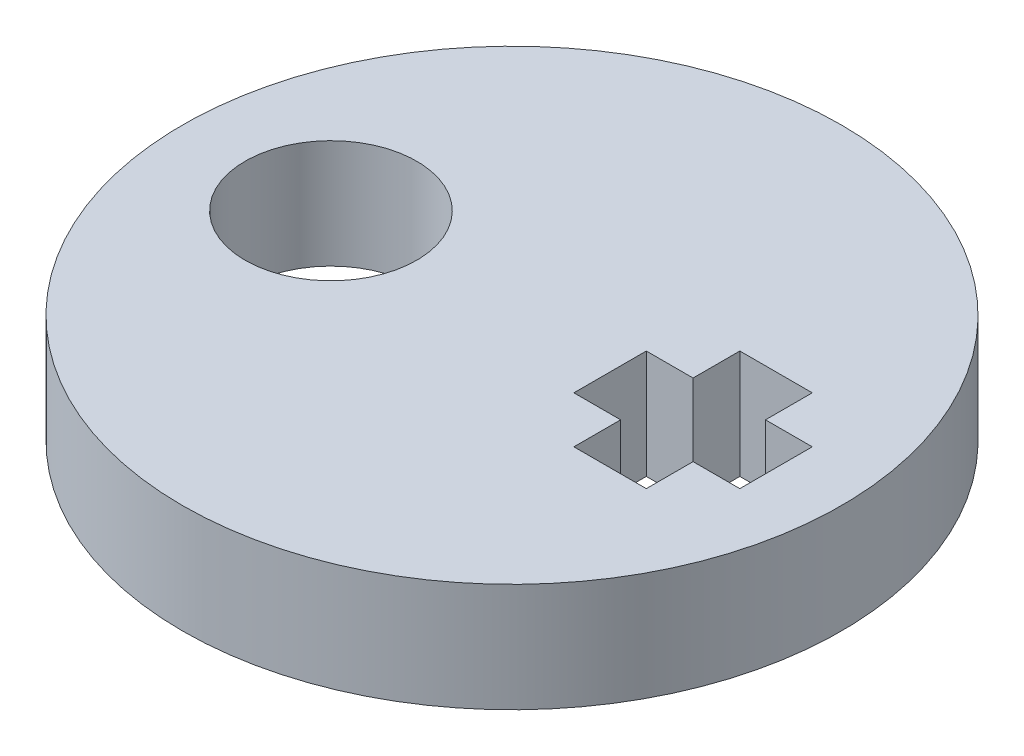
ISO-10303-21;
HEADER;
FILE_DESCRIPTION(('STEP AP214'),'2;1');
FILE_NAME('part.step','',(''),(''),'','','');
FILE_SCHEMA(('AUTOMOTIVE_DESIGN { 1 0 10303 214 1 1 1 1 }'));
ENDSEC;
DATA;
#1=APPLICATION_CONTEXT('core data for automotive mechanical design processes');
#2=APPLICATION_PROTOCOL_DEFINITION('international standard','automotive_design',2000,#1);
#3=PRODUCT_CONTEXT('',#1,'mechanical');
#4=PRODUCT('Part','Part','',(#3));
#5=PRODUCT_RELATED_PRODUCT_CATEGORY('part','',(#4));
#6=PRODUCT_DEFINITION_FORMATION('','',#4);
#7=PRODUCT_DEFINITION_CONTEXT('part definition',#1,'design');
#8=PRODUCT_DEFINITION('design','',#6,#7);
#9=PRODUCT_DEFINITION_SHAPE('','',#8);
#10=(LENGTH_UNIT() NAMED_UNIT(*) SI_UNIT(.MILLI.,.METRE.));
#11=(NAMED_UNIT(*) PLANE_ANGLE_UNIT() SI_UNIT($,.RADIAN.));
#12=(NAMED_UNIT(*) SI_UNIT($,.STERADIAN.) SOLID_ANGLE_UNIT());
#13=UNCERTAINTY_MEASURE_WITH_UNIT(LENGTH_MEASURE(1.E-05),#10,'distance_accuracy_value','');
#14=(GEOMETRIC_REPRESENTATION_CONTEXT(3) GLOBAL_UNCERTAINTY_ASSIGNED_CONTEXT((#13)) GLOBAL_UNIT_ASSIGNED_CONTEXT((#10,
#11,#12)) REPRESENTATION_CONTEXT('',''));
#15=CARTESIAN_POINT('',(0.,0.,0.));
#16=DIRECTION('',(0.,0.,1.));
#17=DIRECTION('',(1.,0.,0.));
#18=AXIS2_PLACEMENT_3D('',#15,#16,#17);
#19=CARTESIAN_POINT('',(0.,3.,0.));
#20=DIRECTION('',(0.,1.,0.));
#21=DIRECTION('',(0.,0.,1.));
#22=AXIS2_PLACEMENT_3D('',#19,#20,#21);
#23=PLANE('',#22);
#24=DIRECTION('',(-1.,0.,0.));
#25=VECTOR('',#24,1.);
#26=CARTESIAN_POINT('',(5.99999999999999,3.,-0.999999999999555));
#27=LINE('',#26,#25);
#28=CARTESIAN_POINT('',(7.29128784747793,3.,-0.999999999999554));
#29=VERTEX_POINT('',#28);
#30=CARTESIAN_POINT('',(5.99999999999999,3.,-0.999999999999555));
#31=VERTEX_POINT('',#30);
#32=EDGE_CURVE('E144',#29,#31,#27,.T.);
#33=ORIENTED_EDGE('',*,*,#32,.F.);
#34=DIRECTION('',(0.,0.,-1.));
#35=VECTOR('',#34,1.);
#36=CARTESIAN_POINT('',(7.29128784747793,3.,-0.999999999999554));
#37=LINE('',#36,#35);
#38=CARTESIAN_POINT('',(7.29128784747793,3.,1.00000000000043));
#39=VERTEX_POINT('',#38);
#40=EDGE_CURVE('E135',#39,#29,#37,.T.);
#41=ORIENTED_EDGE('',*,*,#40,.F.);
#42=DIRECTION('',(1.,0.,0.));
#43=VECTOR('',#42,1.);
#44=CARTESIAN_POINT('',(7.29128784747793,3.,1.00000000000043));
#45=LINE('',#44,#43);
#46=CARTESIAN_POINT('',(5.99999999999999,3.,1.00000000000043));
#47=VERTEX_POINT('',#46);
#48=EDGE_CURVE('E189',#47,#39,#45,.T.);
#49=ORIENTED_EDGE('',*,*,#48,.F.);
#50=DIRECTION('',(0.,0.,-1.));
#51=VECTOR('',#50,1.);
#52=CARTESIAN_POINT('',(5.99999999999999,3.,1.00000000000043));
#53=LINE('',#52,#51);
#54=CARTESIAN_POINT('',(5.99999999999999,3.,2.29128784747835));
#55=VERTEX_POINT('',#54);
#56=EDGE_CURVE('E186',#55,#47,#53,.T.);
#57=ORIENTED_EDGE('',*,*,#56,.F.);
#58=DIRECTION('',(1.,0.,1.67400815431763E-13));
#59=VECTOR('',#58,1.);
#60=CARTESIAN_POINT('',(5.99999999999999,3.,2.29128784747835));
#61=LINE('',#60,#59);
#62=CARTESIAN_POINT('',(4.00000000000001,3.,2.29128784747801));
#63=VERTEX_POINT('',#62);
#64=EDGE_CURVE('E183',#63,#55,#61,.T.);
#65=ORIENTED_EDGE('',*,*,#64,.F.);
#66=DIRECTION('',(0.,0.,1.));
#67=VECTOR('',#66,1.);
#68=CARTESIAN_POINT('',(4.00000000000001,3.,2.29128784747801));
#69=LINE('',#68,#67);
#70=CARTESIAN_POINT('',(4.00000000000001,3.,1.00000000000009));
#71=VERTEX_POINT('',#70);
#72=EDGE_CURVE('E180',#71,#63,#69,.T.);
#73=ORIENTED_EDGE('',*,*,#72,.F.);
#74=DIRECTION('',(1.,0.,0.));
#75=VECTOR('',#74,1.);
#76=CARTESIAN_POINT('',(4.00000000000001,3.,1.00000000000009));
#77=LINE('',#76,#75);
#78=CARTESIAN_POINT('',(2.70871215252208,3.,1.00000000000008));
#79=VERTEX_POINT('',#78);
#80=EDGE_CURVE('E177',#79,#71,#77,.T.);
#81=ORIENTED_EDGE('',*,*,#80,.F.);
#82=DIRECTION('',(0.,0.,1.));
#83=VECTOR('',#82,1.);
#84=CARTESIAN_POINT('',(2.70871215252208,3.,1.00000000000008));
#85=LINE('',#84,#83);
#86=CARTESIAN_POINT('',(2.70871215252208,3.,-1.00000000000008));
#87=VERTEX_POINT('',#86);
#88=EDGE_CURVE('E174',#87,#79,#85,.T.);
#89=ORIENTED_EDGE('',*,*,#88,.F.);
#90=DIRECTION('',(-1.,0.,0.));
#91=VECTOR('',#90,1.);
#92=CARTESIAN_POINT('',(2.70871215252208,3.,-1.00000000000008));
#93=LINE('',#92,#91);
#94=CARTESIAN_POINT('',(4.00000000000001,3.,-1.00000000000008));
#95=VERTEX_POINT('',#94);
#96=EDGE_CURVE('E171',#95,#87,#93,.T.);
#97=ORIENTED_EDGE('',*,*,#96,.F.);
#98=DIRECTION('',(0.,0.,1.));
#99=VECTOR('',#98,1.);
#100=CARTESIAN_POINT('',(4.00000000000001,3.,-1.00000000000008));
#101=LINE('',#100,#99);
#102=CARTESIAN_POINT('',(4.00000000000001,3.,-2.29128784747766));
#103=VERTEX_POINT('',#102);
#104=EDGE_CURVE('E168',#103,#95,#101,.T.);
#105=ORIENTED_EDGE('',*,*,#104,.F.);
#106=DIRECTION('',(-1.,0.,0.));
#107=VECTOR('',#106,1.);
#108=CARTESIAN_POINT('',(4.00000000000001,3.,-2.29128784747766));
#109=LINE('',#108,#107);
#110=CARTESIAN_POINT('',(5.99999999999999,3.,-2.29128784747766));
#111=VERTEX_POINT('',#110);
#112=EDGE_CURVE('E162',#111,#103,#109,.T.);
#113=ORIENTED_EDGE('',*,*,#112,.F.);
#114=DIRECTION('',(0.,0.,-1.));
#115=VECTOR('',#114,1.);
#116=CARTESIAN_POINT('',(5.99999999999999,3.,-2.29128784747766));
#117=LINE('',#116,#115);
#118=EDGE_CURVE('E158',#31,#111,#117,.T.);
#119=ORIENTED_EDGE('',*,*,#118,.F.);
#120=EDGE_LOOP('',(#33,#41,#49,#57,#65,#73,#81,#89,#97,#105,#113,#119));
#121=FACE_BOUND('',#120,.T.);
#122=CARTESIAN_POINT('',(0.,3.,0.));
#123=DIRECTION('',(0.,1.,0.));
#124=DIRECTION('',(0.,0.,1.));
#125=AXIS2_PLACEMENT_3D('',#122,#123,#124);
#126=CIRCLE('',#125,9.1);
#127=CARTESIAN_POINT('',(0.,3.,9.1));
#128=VERTEX_POINT('',#127);
#129=EDGE_CURVE('E11',#128,#128,#126,.T.);
#130=ORIENTED_EDGE('',*,*,#129,.T.);
#131=EDGE_LOOP('',(#130));
#132=FACE_BOUND('',#131,.T.);
#133=CARTESIAN_POINT('',(-5.,3.,0.));
#134=DIRECTION('',(0.,1.,0.));
#135=DIRECTION('',(0.,0.,1.));
#136=AXIS2_PLACEMENT_3D('',#133,#134,#135);
#137=CIRCLE('',#136,2.37);
#138=CARTESIAN_POINT('',(-5.,3.,2.37));
#139=VERTEX_POINT('',#138);
#140=EDGE_CURVE('E194',#139,#139,#137,.T.);
#141=ORIENTED_EDGE('',*,*,#140,.F.);
#142=EDGE_LOOP('',(#141));
#143=FACE_BOUND('',#142,.T.);
#144=ADVANCED_FACE('F45',(#121,#132,#143),#23,.T.);
#145=CARTESIAN_POINT('',(0.,0.,0.));
#146=DIRECTION('',(0.,1.,0.));
#147=DIRECTION('',(0.,0.,1.));
#148=AXIS2_PLACEMENT_3D('',#145,#146,#147);
#149=PLANE('',#148);
#150=CARTESIAN_POINT('',(0.,0.,0.));
#151=DIRECTION('',(0.,1.,0.));
#152=DIRECTION('',(0.,0.,1.));
#153=AXIS2_PLACEMENT_3D('',#150,#151,#152);
#154=CIRCLE('',#153,9.1);
#155=CARTESIAN_POINT('',(0.,0.,9.1));
#156=VERTEX_POINT('',#155);
#157=EDGE_CURVE('E49',#156,#156,#154,.T.);
#158=ORIENTED_EDGE('',*,*,#157,.F.);
#159=EDGE_LOOP('',(#158));
#160=FACE_BOUND('',#159,.T.);
#161=DIRECTION('',(0.,0.,-1.));
#162=VECTOR('',#161,1.);
#163=CARTESIAN_POINT('',(7.29128784747793,0.,-0.999999999999554));
#164=LINE('',#163,#162);
#165=CARTESIAN_POINT('',(7.29128784747793,0.,1.00000000000043));
#166=VERTEX_POINT('',#165);
#167=CARTESIAN_POINT('',(7.29128784747793,0.,-0.999999999999554));
#168=VERTEX_POINT('',#167);
#169=EDGE_CURVE('E69',#166,#168,#164,.T.);
#170=ORIENTED_EDGE('',*,*,#169,.T.);
#171=DIRECTION('',(-1.,0.,0.));
#172=VECTOR('',#171,1.);
#173=CARTESIAN_POINT('',(5.99999999999999,0.,-0.999999999999555));
#174=LINE('',#173,#172);
#175=CARTESIAN_POINT('',(5.99999999999999,0.,-0.999999999999555));
#176=VERTEX_POINT('',#175);
#177=EDGE_CURVE('E151',#168,#176,#174,.T.);
#178=ORIENTED_EDGE('',*,*,#177,.T.);
#179=DIRECTION('',(0.,0.,-1.));
#180=VECTOR('',#179,1.);
#181=CARTESIAN_POINT('',(5.99999999999999,0.,-2.29128784747766));
#182=LINE('',#181,#180);
#183=CARTESIAN_POINT('',(5.99999999999999,0.,-2.29128784747766));
#184=VERTEX_POINT('',#183);
#185=EDGE_CURVE('E197',#176,#184,#182,.T.);
#186=ORIENTED_EDGE('',*,*,#185,.T.);
#187=DIRECTION('',(-1.,0.,0.));
#188=VECTOR('',#187,1.);
#189=CARTESIAN_POINT('',(4.00000000000001,0.,-2.29128784747766));
#190=LINE('',#189,#188);
#191=CARTESIAN_POINT('',(4.00000000000001,0.,-2.29128784747766));
#192=VERTEX_POINT('',#191);
#193=EDGE_CURVE('E201',#184,#192,#190,.T.);
#194=ORIENTED_EDGE('',*,*,#193,.T.);
#195=DIRECTION('',(0.,0.,1.));
#196=VECTOR('',#195,1.);
#197=CARTESIAN_POINT('',(4.00000000000001,0.,-1.00000000000008));
#198=LINE('',#197,#196);
#199=CARTESIAN_POINT('',(4.00000000000001,0.,-1.00000000000008));
#200=VERTEX_POINT('',#199);
#201=EDGE_CURVE('E205',#192,#200,#198,.T.);
#202=ORIENTED_EDGE('',*,*,#201,.T.);
#203=DIRECTION('',(-1.,0.,0.));
#204=VECTOR('',#203,1.);
#205=CARTESIAN_POINT('',(2.70871215252208,0.,-1.00000000000008));
#206=LINE('',#205,#204);
#207=CARTESIAN_POINT('',(2.70871215252208,0.,-1.00000000000008));
#208=VERTEX_POINT('',#207);
#209=EDGE_CURVE('E209',#200,#208,#206,.T.);
#210=ORIENTED_EDGE('',*,*,#209,.T.);
#211=DIRECTION('',(0.,0.,1.));
#212=VECTOR('',#211,1.);
#213=CARTESIAN_POINT('',(2.70871215252208,0.,1.00000000000008));
#214=LINE('',#213,#212);
#215=CARTESIAN_POINT('',(2.70871215252208,0.,1.00000000000008));
#216=VERTEX_POINT('',#215);
#217=EDGE_CURVE('E213',#208,#216,#214,.T.);
#218=ORIENTED_EDGE('',*,*,#217,.T.);
#219=DIRECTION('',(1.,0.,0.));
#220=VECTOR('',#219,1.);
#221=CARTESIAN_POINT('',(4.00000000000001,0.,1.00000000000009));
#222=LINE('',#221,#220);
#223=CARTESIAN_POINT('',(4.00000000000001,0.,1.00000000000009));
#224=VERTEX_POINT('',#223);
#225=EDGE_CURVE('E217',#216,#224,#222,.T.);
#226=ORIENTED_EDGE('',*,*,#225,.T.);
#227=DIRECTION('',(0.,0.,1.));
#228=VECTOR('',#227,1.);
#229=CARTESIAN_POINT('',(4.00000000000001,0.,2.29128784747801));
#230=LINE('',#229,#228);
#231=CARTESIAN_POINT('',(4.00000000000001,0.,2.29128784747801));
#232=VERTEX_POINT('',#231);
#233=EDGE_CURVE('E221',#224,#232,#230,.T.);
#234=ORIENTED_EDGE('',*,*,#233,.T.);
#235=DIRECTION('',(1.,0.,1.67400815431763E-13));
#236=VECTOR('',#235,1.);
#237=CARTESIAN_POINT('',(5.99999999999999,0.,2.29128784747835));
#238=LINE('',#237,#236);
#239=CARTESIAN_POINT('',(5.99999999999999,0.,2.29128784747835));
#240=VERTEX_POINT('',#239);
#241=EDGE_CURVE('E225',#232,#240,#238,.T.);
#242=ORIENTED_EDGE('',*,*,#241,.T.);
#243=DIRECTION('',(0.,0.,-1.));
#244=VECTOR('',#243,1.);
#245=CARTESIAN_POINT('',(5.99999999999999,0.,1.00000000000043));
#246=LINE('',#245,#244);
#247=CARTESIAN_POINT('',(5.99999999999999,0.,1.00000000000043));
#248=VERTEX_POINT('',#247);
#249=EDGE_CURVE('E229',#240,#248,#246,.T.);
#250=ORIENTED_EDGE('',*,*,#249,.T.);
#251=DIRECTION('',(1.,0.,0.));
#252=VECTOR('',#251,1.);
#253=CARTESIAN_POINT('',(7.29128784747793,0.,1.00000000000043));
#254=LINE('',#253,#252);
#255=EDGE_CURVE('E145',#248,#166,#254,.T.);
#256=ORIENTED_EDGE('',*,*,#255,.T.);
#257=EDGE_LOOP('',(#170,#178,#186,#194,#202,#210,#218,#226,#234,#242,#250,#256));
#258=FACE_BOUND('',#257,.T.);
#259=CARTESIAN_POINT('',(-5.,0.,0.));
#260=DIRECTION('',(0.,1.,0.));
#261=DIRECTION('',(0.,0.,1.));
#262=AXIS2_PLACEMENT_3D('',#259,#260,#261);
#263=CIRCLE('',#262,2.37);
#264=CARTESIAN_POINT('',(-5.,0.,2.37));
#265=VERTEX_POINT('',#264);
#266=EDGE_CURVE('E424',#265,#265,#263,.T.);
#267=ORIENTED_EDGE('',*,*,#266,.T.);
#268=EDGE_LOOP('',(#267));
#269=FACE_BOUND('',#268,.T.);
#270=ADVANCED_FACE('F271',(#160,#258,#269),#149,.F.);
#271=CARTESIAN_POINT('',(0.,3.,0.));
#272=DIRECTION('',(0.,-1.,0.));
#273=DIRECTION('',(0.,0.,-1.));
#274=AXIS2_PLACEMENT_3D('',#271,#272,#273);
#275=CYLINDRICAL_SURFACE('',#274,9.1);
#276=ORIENTED_EDGE('',*,*,#129,.F.);
#277=EDGE_LOOP('',(#276));
#278=FACE_BOUND('',#277,.T.);
#279=ORIENTED_EDGE('',*,*,#157,.T.);
#280=EDGE_LOOP('',(#279));
#281=FACE_BOUND('',#280,.T.);
#282=ADVANCED_FACE('F47',(#278,#281),#275,.T.);
#283=CARTESIAN_POINT('',(7.29128784747793,3.,-0.999999999999554));
#284=DIRECTION('',(-1.,0.,0.));
#285=DIRECTION('',(0.,0.,1.));
#286=AXIS2_PLACEMENT_3D('',#283,#284,#285);
#287=PLANE('',#286);
#288=ORIENTED_EDGE('',*,*,#169,.F.);
#289=DIRECTION('',(0.,-1.,0.));
#290=VECTOR('',#289,1.);
#291=CARTESIAN_POINT('',(7.29128784747793,3.,1.00000000000043));
#292=LINE('',#291,#290);
#293=EDGE_CURVE('E139',#39,#166,#292,.T.);
#294=ORIENTED_EDGE('',*,*,#293,.F.);
#295=ORIENTED_EDGE('',*,*,#40,.T.);
#296=DIRECTION('',(0.,-1.,0.));
#297=VECTOR('',#296,1.);
#298=CARTESIAN_POINT('',(7.29128784747793,3.,-0.999999999999554));
#299=LINE('',#298,#297);
#300=EDGE_CURVE('E138',#29,#168,#299,.T.);
#301=ORIENTED_EDGE('',*,*,#300,.T.);
#302=EDGE_LOOP('',(#288,#294,#295,#301));
#303=FACE_BOUND('',#302,.T.);
#304=ADVANCED_FACE('F137',(#303),#287,.T.);
#305=CARTESIAN_POINT('',(5.99999999999999,3.,-0.999999999999555));
#306=DIRECTION('',(0.,0.,1.));
#307=DIRECTION('',(1.,0.,0.));
#308=AXIS2_PLACEMENT_3D('',#305,#306,#307);
#309=PLANE('',#308);
#310=ORIENTED_EDGE('',*,*,#177,.F.);
#311=ORIENTED_EDGE('',*,*,#300,.F.);
#312=ORIENTED_EDGE('',*,*,#32,.T.);
#313=DIRECTION('',(0.,-1.,0.));
#314=VECTOR('',#313,1.);
#315=CARTESIAN_POINT('',(5.99999999999999,3.,-0.999999999999555));
#316=LINE('',#315,#314);
#317=EDGE_CURVE('E153',#31,#176,#316,.T.);
#318=ORIENTED_EDGE('',*,*,#317,.T.);
#319=EDGE_LOOP('',(#310,#311,#312,#318));
#320=FACE_BOUND('',#319,.T.);
#321=ADVANCED_FACE('F148',(#320),#309,.T.);
#322=CARTESIAN_POINT('',(5.99999999999999,3.,-2.29128784747766));
#323=DIRECTION('',(-1.,0.,0.));
#324=DIRECTION('',(0.,0.,1.));
#325=AXIS2_PLACEMENT_3D('',#322,#323,#324);
#326=PLANE('',#325);
#327=ORIENTED_EDGE('',*,*,#185,.F.);
#328=ORIENTED_EDGE('',*,*,#317,.F.);
#329=ORIENTED_EDGE('',*,*,#118,.T.);
#330=DIRECTION('',(0.,-1.,0.));
#331=VECTOR('',#330,1.);
#332=CARTESIAN_POINT('',(5.99999999999999,3.,-2.29128784747766));
#333=LINE('',#332,#331);
#334=EDGE_CURVE('E261',#111,#184,#333,.T.);
#335=ORIENTED_EDGE('',*,*,#334,.T.);
#336=EDGE_LOOP('',(#327,#328,#329,#335));
#337=FACE_BOUND('',#336,.T.);
#338=ADVANCED_FACE('F267',(#337),#326,.T.);
#339=CARTESIAN_POINT('',(4.00000000000001,3.,-2.29128784747766));
#340=DIRECTION('',(0.,0.,1.));
#341=DIRECTION('',(1.,0.,0.));
#342=AXIS2_PLACEMENT_3D('',#339,#340,#341);
#343=PLANE('',#342);
#344=ORIENTED_EDGE('',*,*,#193,.F.);
#345=ORIENTED_EDGE('',*,*,#334,.F.);
#346=ORIENTED_EDGE('',*,*,#112,.T.);
#347=DIRECTION('',(0.,-1.,0.));
#348=VECTOR('',#347,1.);
#349=CARTESIAN_POINT('',(4.00000000000001,3.,-2.29128784747766));
#350=LINE('',#349,#348);
#351=EDGE_CURVE('E258',#103,#192,#350,.T.);
#352=ORIENTED_EDGE('',*,*,#351,.T.);
#353=EDGE_LOOP('',(#344,#345,#346,#352));
#354=FACE_BOUND('',#353,.T.);
#355=ADVANCED_FACE('F310',(#354),#343,.T.);
#356=CARTESIAN_POINT('',(4.00000000000001,3.,-1.00000000000008));
#357=DIRECTION('',(1.,0.,0.));
#358=DIRECTION('',(0.,0.,-1.));
#359=AXIS2_PLACEMENT_3D('',#356,#357,#358);
#360=PLANE('',#359);
#361=ORIENTED_EDGE('',*,*,#201,.F.);
#362=ORIENTED_EDGE('',*,*,#351,.F.);
#363=ORIENTED_EDGE('',*,*,#104,.T.);
#364=DIRECTION('',(0.,-1.,0.));
#365=VECTOR('',#364,1.);
#366=CARTESIAN_POINT('',(4.00000000000001,3.,-1.00000000000008));
#367=LINE('',#366,#365);
#368=EDGE_CURVE('E255',#95,#200,#367,.T.);
#369=ORIENTED_EDGE('',*,*,#368,.T.);
#370=EDGE_LOOP('',(#361,#362,#363,#369));
#371=FACE_BOUND('',#370,.T.);
#372=ADVANCED_FACE('F308',(#371),#360,.T.);
#373=CARTESIAN_POINT('',(2.70871215252208,3.,-1.00000000000008));
#374=DIRECTION('',(0.,0.,1.));
#375=DIRECTION('',(1.,0.,0.));
#376=AXIS2_PLACEMENT_3D('',#373,#374,#375);
#377=PLANE('',#376);
#378=ORIENTED_EDGE('',*,*,#209,.F.);
#379=ORIENTED_EDGE('',*,*,#368,.F.);
#380=ORIENTED_EDGE('',*,*,#96,.T.);
#381=DIRECTION('',(0.,-1.,0.));
#382=VECTOR('',#381,1.);
#383=CARTESIAN_POINT('',(2.70871215252208,3.,-1.00000000000008));
#384=LINE('',#383,#382);
#385=EDGE_CURVE('E252',#87,#208,#384,.T.);
#386=ORIENTED_EDGE('',*,*,#385,.T.);
#387=EDGE_LOOP('',(#378,#379,#380,#386));
#388=FACE_BOUND('',#387,.T.);
#389=ADVANCED_FACE('F302',(#388),#377,.T.);
#390=CARTESIAN_POINT('',(2.70871215252208,3.,1.00000000000008));
#391=DIRECTION('',(1.,0.,0.));
#392=DIRECTION('',(0.,0.,-1.));
#393=AXIS2_PLACEMENT_3D('',#390,#391,#392);
#394=PLANE('',#393);
#395=ORIENTED_EDGE('',*,*,#217,.F.);
#396=ORIENTED_EDGE('',*,*,#385,.F.);
#397=ORIENTED_EDGE('',*,*,#88,.T.);
#398=DIRECTION('',(0.,-1.,0.));
#399=VECTOR('',#398,1.);
#400=CARTESIAN_POINT('',(2.70871215252208,3.,1.00000000000008));
#401=LINE('',#400,#399);
#402=EDGE_CURVE('E249',#79,#216,#401,.T.);
#403=ORIENTED_EDGE('',*,*,#402,.T.);
#404=EDGE_LOOP('',(#395,#396,#397,#403));
#405=FACE_BOUND('',#404,.T.);
#406=ADVANCED_FACE('F298',(#405),#394,.T.);
#407=CARTESIAN_POINT('',(4.00000000000001,3.,1.00000000000009));
#408=DIRECTION('',(0.,0.,-1.));
#409=DIRECTION('',(-1.,0.,0.));
#410=AXIS2_PLACEMENT_3D('',#407,#408,#409);
#411=PLANE('',#410);
#412=ORIENTED_EDGE('',*,*,#225,.F.);
#413=ORIENTED_EDGE('',*,*,#402,.F.);
#414=ORIENTED_EDGE('',*,*,#80,.T.);
#415=DIRECTION('',(0.,-1.,0.));
#416=VECTOR('',#415,1.);
#417=CARTESIAN_POINT('',(4.00000000000001,3.,1.00000000000009));
#418=LINE('',#417,#416);
#419=EDGE_CURVE('E246',#71,#224,#418,.T.);
#420=ORIENTED_EDGE('',*,*,#419,.T.);
#421=EDGE_LOOP('',(#412,#413,#414,#420));
#422=FACE_BOUND('',#421,.T.);
#423=ADVANCED_FACE('F295',(#422),#411,.T.);
#424=CARTESIAN_POINT('',(4.00000000000001,3.,2.29128784747801));
#425=DIRECTION('',(1.,0.,0.));
#426=DIRECTION('',(0.,0.,-1.));
#427=AXIS2_PLACEMENT_3D('',#424,#425,#426);
#428=PLANE('',#427);
#429=ORIENTED_EDGE('',*,*,#233,.F.);
#430=ORIENTED_EDGE('',*,*,#419,.F.);
#431=ORIENTED_EDGE('',*,*,#72,.T.);
#432=DIRECTION('',(0.,-1.,0.));
#433=VECTOR('',#432,1.);
#434=CARTESIAN_POINT('',(4.00000000000001,3.,2.29128784747801));
#435=LINE('',#434,#433);
#436=EDGE_CURVE('E243',#63,#232,#435,.T.);
#437=ORIENTED_EDGE('',*,*,#436,.T.);
#438=EDGE_LOOP('',(#429,#430,#431,#437));
#439=FACE_BOUND('',#438,.T.);
#440=ADVANCED_FACE('F287',(#439),#428,.T.);
#441=CARTESIAN_POINT('',(5.99999999999999,3.,2.29128784747835));
#442=DIRECTION('',(1.67400815431763E-13,0.,-1.));
#443=DIRECTION('',(-1.,0.,-1.67400815431763E-13));
#444=AXIS2_PLACEMENT_3D('',#441,#442,#443);
#445=PLANE('',#444);
#446=ORIENTED_EDGE('',*,*,#241,.F.);
#447=ORIENTED_EDGE('',*,*,#436,.F.);
#448=ORIENTED_EDGE('',*,*,#64,.T.);
#449=DIRECTION('',(0.,-1.,0.));
#450=VECTOR('',#449,1.);
#451=CARTESIAN_POINT('',(5.99999999999999,3.,2.29128784747835));
#452=LINE('',#451,#450);
#453=EDGE_CURVE('E240',#55,#240,#452,.T.);
#454=ORIENTED_EDGE('',*,*,#453,.T.);
#455=EDGE_LOOP('',(#446,#447,#448,#454));
#456=FACE_BOUND('',#455,.T.);
#457=ADVANCED_FACE('F283',(#456),#445,.T.);
#458=CARTESIAN_POINT('',(5.99999999999999,3.,1.00000000000043));
#459=DIRECTION('',(-1.,0.,0.));
#460=DIRECTION('',(0.,0.,1.));
#461=AXIS2_PLACEMENT_3D('',#458,#459,#460);
#462=PLANE('',#461);
#463=ORIENTED_EDGE('',*,*,#249,.F.);
#464=ORIENTED_EDGE('',*,*,#453,.F.);
#465=ORIENTED_EDGE('',*,*,#56,.T.);
#466=DIRECTION('',(0.,-1.,0.));
#467=VECTOR('',#466,1.);
#468=CARTESIAN_POINT('',(5.99999999999999,3.,1.00000000000043));
#469=LINE('',#468,#467);
#470=EDGE_CURVE('E61',#47,#248,#469,.T.);
#471=ORIENTED_EDGE('',*,*,#470,.T.);
#472=EDGE_LOOP('',(#463,#464,#465,#471));
#473=FACE_BOUND('',#472,.T.);
#474=ADVANCED_FACE('F280',(#473),#462,.T.);
#475=CARTESIAN_POINT('',(7.29128784747793,3.,1.00000000000043));
#476=DIRECTION('',(0.,0.,-1.));
#477=DIRECTION('',(-1.,0.,0.));
#478=AXIS2_PLACEMENT_3D('',#475,#476,#477);
#479=PLANE('',#478);
#480=ORIENTED_EDGE('',*,*,#255,.F.);
#481=ORIENTED_EDGE('',*,*,#470,.F.);
#482=ORIENTED_EDGE('',*,*,#48,.T.);
#483=ORIENTED_EDGE('',*,*,#293,.T.);
#484=EDGE_LOOP('',(#480,#481,#482,#483));
#485=FACE_BOUND('',#484,.T.);
#486=ADVANCED_FACE('F274',(#485),#479,.T.);
#487=CARTESIAN_POINT('',(-5.,3.,0.));
#488=DIRECTION('',(0.,-1.,0.));
#489=DIRECTION('',(0.,0.,-1.));
#490=AXIS2_PLACEMENT_3D('',#487,#488,#489);
#491=CYLINDRICAL_SURFACE('',#490,2.37);
#492=ORIENTED_EDGE('',*,*,#140,.T.);
#493=EDGE_LOOP('',(#492));
#494=FACE_BOUND('',#493,.T.);
#495=ORIENTED_EDGE('',*,*,#266,.F.);
#496=EDGE_LOOP('',(#495));
#497=FACE_BOUND('',#496,.T.);
#498=ADVANCED_FACE('F407',(#494,#497),#491,.F.);
#499=CLOSED_SHELL('',(#144,#270,#282,#304,#321,#338,#355,#372,#389,#406,#423,#440,#457,#474,
#486,#498));
#500=MANIFOLD_SOLID_BREP('B2',#499);
#501=ADVANCED_BREP_SHAPE_REPRESENTATION('',(#18,#500),#14);
#502=SHAPE_DEFINITION_REPRESENTATION(#9,#501);
ENDSEC;
END-ISO-10303-21;
